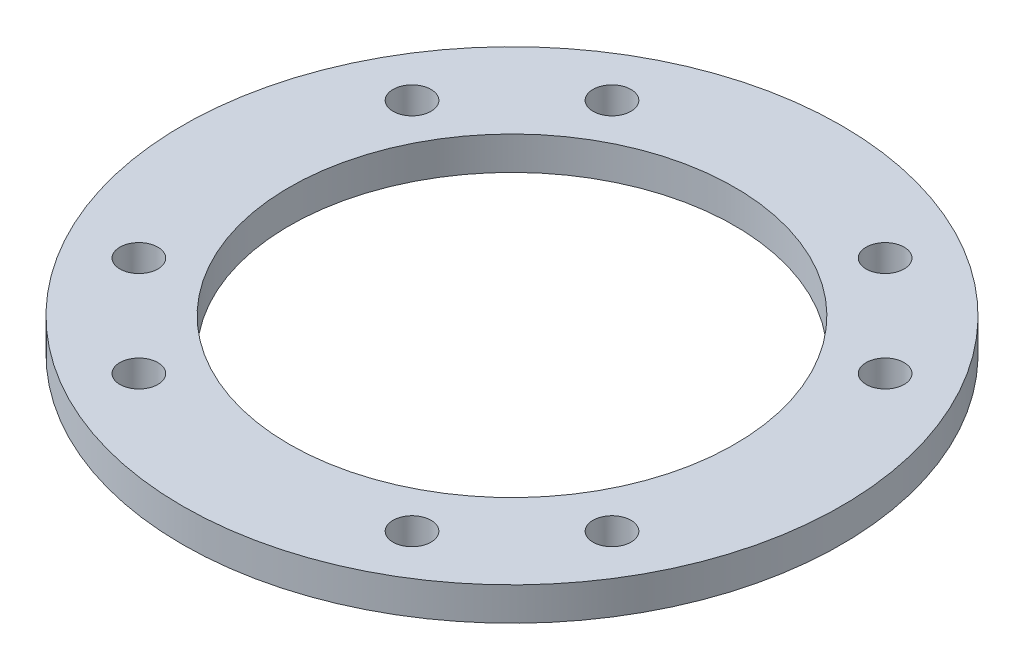
ISO-10303-21;
HEADER;
FILE_DESCRIPTION(('STEP AP214'),'2;1');
FILE_NAME('part.step','',(''),(''),'','','');
FILE_SCHEMA(('AUTOMOTIVE_DESIGN { 1 0 10303 214 1 1 1 1 }'));
ENDSEC;
DATA;
#1=APPLICATION_CONTEXT('core data for automotive mechanical design processes');
#2=APPLICATION_PROTOCOL_DEFINITION('international standard','automotive_design',2000,#1);
#3=PRODUCT_CONTEXT('',#1,'mechanical');
#4=PRODUCT('Part','Part','',(#3));
#5=PRODUCT_RELATED_PRODUCT_CATEGORY('part','',(#4));
#6=PRODUCT_DEFINITION_FORMATION('','',#4);
#7=PRODUCT_DEFINITION_CONTEXT('part definition',#1,'design');
#8=PRODUCT_DEFINITION('design','',#6,#7);
#9=PRODUCT_DEFINITION_SHAPE('','',#8);
#10=(LENGTH_UNIT() NAMED_UNIT(*) SI_UNIT(.MILLI.,.METRE.));
#11=(NAMED_UNIT(*) PLANE_ANGLE_UNIT() SI_UNIT($,.RADIAN.));
#12=(NAMED_UNIT(*) SI_UNIT($,.STERADIAN.) SOLID_ANGLE_UNIT());
#13=UNCERTAINTY_MEASURE_WITH_UNIT(LENGTH_MEASURE(1.E-05),#10,'distance_accuracy_value','');
#14=(GEOMETRIC_REPRESENTATION_CONTEXT(3) GLOBAL_UNCERTAINTY_ASSIGNED_CONTEXT((#13)) GLOBAL_UNIT_ASSIGNED_CONTEXT((#10,
#11,#12)) REPRESENTATION_CONTEXT('',''));
#15=CARTESIAN_POINT('',(0.,0.,0.));
#16=DIRECTION('',(0.,0.,1.));
#17=DIRECTION('',(1.,0.,0.));
#18=AXIS2_PLACEMENT_3D('',#15,#16,#17);
#19=CARTESIAN_POINT('',(0.,-40.6471311900001,0.));
#20=DIRECTION('',(0.,1.,0.));
#21=DIRECTION('',(0.,0.,1.));
#22=AXIS2_PLACEMENT_3D('',#19,#20,#21);
#23=PLANE('',#22);
#24=CARTESIAN_POINT('',(0.,-40.6471311900001,0.));
#25=DIRECTION('',(0.,1.,0.));
#26=DIRECTION('',(0.,0.,1.));
#27=AXIS2_PLACEMENT_3D('',#24,#25,#26);
#28=CIRCLE('',#27,37.5);
#29=CARTESIAN_POINT('',(0.,-40.6471311900001,37.5));
#30=VERTEX_POINT('',#29);
#31=EDGE_CURVE('E99',#30,#30,#28,.T.);
#32=ORIENTED_EDGE('',*,*,#31,.F.);
#33=EDGE_LOOP('',(#32));
#34=FACE_BOUND('',#33,.T.);
#35=CARTESIAN_POINT('',(0.,-40.6471311900001,0.));
#36=DIRECTION('',(0.,1.,0.));
#37=DIRECTION('',(0.,0.,1.));
#38=AXIS2_PLACEMENT_3D('',#35,#36,#37);
#39=CIRCLE('',#38,55.5);
#40=CARTESIAN_POINT('',(0.,-40.6471311900001,55.5));
#41=VERTEX_POINT('',#40);
#42=EDGE_CURVE('E10',#41,#41,#39,.T.);
#43=ORIENTED_EDGE('',*,*,#42,.T.);
#44=EDGE_LOOP('',(#43));
#45=FACE_BOUND('',#44,.T.);
#46=CARTESIAN_POINT('',(-22.9999999999995,-40.6471311900001,-39.8371685740845));
#47=DIRECTION('',(0.,-1.,0.));
#48=DIRECTION('',(0.,0.,-1.));
#49=AXIS2_PLACEMENT_3D('',#46,#47,#48);
#50=CIRCLE('',#49,3.20000000000001);
#51=CARTESIAN_POINT('',(-22.9999999999995,-40.6471311900001,-43.0371685740845));
#52=VERTEX_POINT('',#51);
#53=EDGE_CURVE('E88',#52,#52,#50,.F.);
#54=ORIENTED_EDGE('',*,*,#53,.F.);
#55=EDGE_LOOP('',(#54));
#56=FACE_BOUND('',#55,.T.);
#57=CARTESIAN_POINT('',(-39.8371685740839,-40.6471311900001,-23.0000000000005));
#58=DIRECTION('',(0.,-1.,0.));
#59=DIRECTION('',(0.,0.,-1.));
#60=AXIS2_PLACEMENT_3D('',#57,#58,#59);
#61=CIRCLE('',#60,3.20000000000001);
#62=CARTESIAN_POINT('',(-39.8371685740839,-40.6471311900001,-26.2000000000005));
#63=VERTEX_POINT('',#62);
#64=EDGE_CURVE('E82',#63,#63,#61,.F.);
#65=ORIENTED_EDGE('',*,*,#64,.F.);
#66=EDGE_LOOP('',(#65));
#67=FACE_BOUND('',#66,.T.);
#68=CARTESIAN_POINT('',(-39.8371685740842,-40.6471311900001,22.9999999999999));
#69=DIRECTION('',(0.,-1.,0.));
#70=DIRECTION('',(0.,0.,-1.));
#71=AXIS2_PLACEMENT_3D('',#68,#69,#70);
#72=CIRCLE('',#71,3.20000000000001);
#73=CARTESIAN_POINT('',(-39.8371685740842,-40.6471311900001,19.7999999999999));
#74=VERTEX_POINT('',#73);
#75=EDGE_CURVE('E76',#74,#74,#72,.F.);
#76=ORIENTED_EDGE('',*,*,#75,.F.);
#77=EDGE_LOOP('',(#76));
#78=FACE_BOUND('',#77,.T.);
#79=CARTESIAN_POINT('',(-23.,-40.6471311900001,39.8371685740842));
#80=DIRECTION('',(0.,-1.,0.));
#81=DIRECTION('',(0.,0.,-1.));
#82=AXIS2_PLACEMENT_3D('',#79,#80,#81);
#83=CIRCLE('',#82,3.20000000000001);
#84=CARTESIAN_POINT('',(-19.8,-40.6471311900001,39.8371685740842));
#85=VERTEX_POINT('',#84);
#86=EDGE_CURVE('E70',#85,#85,#83,.F.);
#87=ORIENTED_EDGE('',*,*,#86,.F.);
#88=EDGE_LOOP('',(#87));
#89=FACE_BOUND('',#88,.T.);
#90=CARTESIAN_POINT('',(22.9999999999998,-40.6471311900001,39.8371685740843));
#91=DIRECTION('',(0.,-1.,0.));
#92=DIRECTION('',(0.,0.,-1.));
#93=AXIS2_PLACEMENT_3D('',#90,#91,#92);
#94=CIRCLE('',#93,3.20000000000001);
#95=CARTESIAN_POINT('',(22.9999999999998,-40.6471311900001,36.6371685740843));
#96=VERTEX_POINT('',#95);
#97=EDGE_CURVE('E64',#96,#96,#94,.F.);
#98=ORIENTED_EDGE('',*,*,#97,.F.);
#99=EDGE_LOOP('',(#98));
#100=FACE_BOUND('',#99,.T.);
#101=CARTESIAN_POINT('',(39.8371685740841,-40.6471311900001,23.0000000000002));
#102=DIRECTION('',(0.,-1.,0.));
#103=DIRECTION('',(0.,0.,-1.));
#104=AXIS2_PLACEMENT_3D('',#101,#102,#103);
#105=CIRCLE('',#104,3.20000000000001);
#106=CARTESIAN_POINT('',(39.8371685740841,-40.6471311900001,19.8000000000002));
#107=VERTEX_POINT('',#106);
#108=EDGE_CURVE('E58',#107,#107,#105,.F.);
#109=ORIENTED_EDGE('',*,*,#108,.F.);
#110=EDGE_LOOP('',(#109));
#111=FACE_BOUND('',#110,.T.);
#112=CARTESIAN_POINT('',(39.8371685740843,-40.6471311900001,-22.9999999999999));
#113=DIRECTION('',(0.,-1.,0.));
#114=DIRECTION('',(0.,0.,-1.));
#115=AXIS2_PLACEMENT_3D('',#112,#113,#114);
#116=CIRCLE('',#115,3.20000000000001);
#117=CARTESIAN_POINT('',(39.8371685740843,-40.6471311900001,-26.1999999999999));
#118=VERTEX_POINT('',#117);
#119=EDGE_CURVE('E53',#118,#118,#116,.F.);
#120=ORIENTED_EDGE('',*,*,#119,.F.);
#121=EDGE_LOOP('',(#120));
#122=FACE_BOUND('',#121,.T.);
#123=CARTESIAN_POINT('',(23.0000000000001,-40.6471311900001,-39.8371685740842));
#124=DIRECTION('',(0.,-1.,0.));
#125=DIRECTION('',(0.,0.,-1.));
#126=AXIS2_PLACEMENT_3D('',#123,#124,#125);
#127=CIRCLE('',#126,3.20000000000001);
#128=CARTESIAN_POINT('',(23.0000000000001,-40.6471311900001,-43.0371685740842));
#129=VERTEX_POINT('',#128);
#130=EDGE_CURVE('E45',#129,#129,#127,.F.);
#131=ORIENTED_EDGE('',*,*,#130,.F.);
#132=EDGE_LOOP('',(#131));
#133=FACE_BOUND('',#132,.T.);
#134=ADVANCED_FACE('F35',(#34,#45,#56,#67,#78,#89,#100,#111,#122,#133),#23,.T.);
#135=CARTESIAN_POINT('',(55.5,-46.25,0.));
#136=DIRECTION('',(0.,1.,0.));
#137=DIRECTION('',(0.,0.,1.));
#138=AXIS2_PLACEMENT_3D('',#135,#136,#137);
#139=PLANE('',#138);
#140=CARTESIAN_POINT('',(0.,-46.25,0.));
#141=DIRECTION('',(0.,1.,0.));
#142=DIRECTION('',(0.,0.,1.));
#143=AXIS2_PLACEMENT_3D('',#140,#141,#142);
#144=CIRCLE('',#143,37.5);
#145=CARTESIAN_POINT('',(0.,-46.25,37.5));
#146=VERTEX_POINT('',#145);
#147=EDGE_CURVE('E94',#146,#146,#144,.F.);
#148=ORIENTED_EDGE('',*,*,#147,.F.);
#149=EDGE_LOOP('',(#148));
#150=FACE_BOUND('',#149,.T.);
#151=CARTESIAN_POINT('',(-22.9999999999995,-46.25,-39.8371685740845));
#152=DIRECTION('',(0.,-1.,0.));
#153=DIRECTION('',(0.50000000000001,0.,-0.866025403784433));
#154=AXIS2_PLACEMENT_3D('',#151,#152,#153);
#155=CIRCLE('',#154,3.20000000000001);
#156=CARTESIAN_POINT('',(-21.3999999999994,-46.25,-42.6084498661947));
#157=VERTEX_POINT('',#156);
#158=EDGE_CURVE('E91',#157,#157,#155,.T.);
#159=ORIENTED_EDGE('',*,*,#158,.F.);
#160=EDGE_LOOP('',(#159));
#161=FACE_BOUND('',#160,.T.);
#162=CARTESIAN_POINT('',(-39.8371685740839,-46.25,-23.0000000000005));
#163=DIRECTION('',(0.,-1.,0.));
#164=DIRECTION('',(0.,0.,-1.));
#165=AXIS2_PLACEMENT_3D('',#162,#163,#164);
#166=CIRCLE('',#165,3.20000000000001);
#167=CARTESIAN_POINT('',(-39.8371685740839,-46.25,-26.2000000000005));
#168=VERTEX_POINT('',#167);
#169=EDGE_CURVE('E85',#168,#168,#166,.T.);
#170=ORIENTED_EDGE('',*,*,#169,.F.);
#171=EDGE_LOOP('',(#170));
#172=FACE_BOUND('',#171,.T.);
#173=CARTESIAN_POINT('',(-39.8371685740842,-46.25,22.9999999999999));
#174=DIRECTION('',(0.,-1.,0.));
#175=DIRECTION('',(-0.866025403784438,0.,-0.500000000000001));
#176=AXIS2_PLACEMENT_3D('',#173,#174,#175);
#177=CIRCLE('',#176,3.20000000000001);
#178=CARTESIAN_POINT('',(-42.6084498661944,-46.25,21.3999999999999));
#179=VERTEX_POINT('',#178);
#180=EDGE_CURVE('E79',#179,#179,#177,.T.);
#181=ORIENTED_EDGE('',*,*,#180,.F.);
#182=EDGE_LOOP('',(#181));
#183=FACE_BOUND('',#182,.T.);
#184=CARTESIAN_POINT('',(-23.,-46.25,39.8371685740842));
#185=DIRECTION('',(0.,-1.,0.));
#186=DIRECTION('',(-1.,0.,0.));
#187=AXIS2_PLACEMENT_3D('',#184,#185,#186);
#188=CIRCLE('',#187,3.20000000000001);
#189=CARTESIAN_POINT('',(-19.8,-46.25,39.8371685740842));
#190=VERTEX_POINT('',#189);
#191=EDGE_CURVE('E73',#190,#190,#188,.T.);
#192=ORIENTED_EDGE('',*,*,#191,.F.);
#193=EDGE_LOOP('',(#192));
#194=FACE_BOUND('',#193,.T.);
#195=CARTESIAN_POINT('',(22.9999999999998,-46.25,39.8371685740843));
#196=DIRECTION('',(0.,-1.,0.));
#197=DIRECTION('',(-0.500000000000004,0.,0.866025403784436));
#198=AXIS2_PLACEMENT_3D('',#195,#196,#197);
#199=CIRCLE('',#198,3.20000000000001);
#200=CARTESIAN_POINT('',(21.3999999999998,-46.25,42.6084498661945));
#201=VERTEX_POINT('',#200);
#202=EDGE_CURVE('E67',#201,#201,#199,.T.);
#203=ORIENTED_EDGE('',*,*,#202,.F.);
#204=EDGE_LOOP('',(#203));
#205=FACE_BOUND('',#204,.T.);
#206=CARTESIAN_POINT('',(39.8371685740841,-46.25,23.0000000000002));
#207=DIRECTION('',(0.,-1.,0.));
#208=DIRECTION('',(0.,0.,1.));
#209=AXIS2_PLACEMENT_3D('',#206,#207,#208);
#210=CIRCLE('',#209,3.20000000000001);
#211=CARTESIAN_POINT('',(39.8371685740841,-46.25,26.2000000000002));
#212=VERTEX_POINT('',#211);
#213=EDGE_CURVE('E61',#212,#212,#210,.T.);
#214=ORIENTED_EDGE('',*,*,#213,.F.);
#215=EDGE_LOOP('',(#214));
#216=FACE_BOUND('',#215,.T.);
#217=CARTESIAN_POINT('',(39.8371685740843,-46.25,-22.9999999999999));
#218=DIRECTION('',(0.,-1.,0.));
#219=DIRECTION('',(0.866025403784438,0.,0.500000000000001));
#220=AXIS2_PLACEMENT_3D('',#217,#218,#219);
#221=CIRCLE('',#220,3.20000000000001);
#222=CARTESIAN_POINT('',(42.6084498661945,-46.25,-21.3999999999999));
#223=VERTEX_POINT('',#222);
#224=EDGE_CURVE('E55',#223,#223,#221,.T.);
#225=ORIENTED_EDGE('',*,*,#224,.F.);
#226=EDGE_LOOP('',(#225));
#227=FACE_BOUND('',#226,.T.);
#228=CARTESIAN_POINT('',(23.0000000000001,-46.25,-39.8371685740842));
#229=DIRECTION('',(0.,-1.,0.));
#230=DIRECTION('',(1.,0.,0.));
#231=AXIS2_PLACEMENT_3D('',#228,#229,#230);
#232=CIRCLE('',#231,3.20000000000001);
#233=CARTESIAN_POINT('',(26.2000000000001,-46.25,-39.8371685740842));
#234=VERTEX_POINT('',#233);
#235=EDGE_CURVE('E49',#234,#234,#232,.T.);
#236=ORIENTED_EDGE('',*,*,#235,.F.);
#237=EDGE_LOOP('',(#236));
#238=FACE_BOUND('',#237,.T.);
#239=CARTESIAN_POINT('',(0.,-46.25,0.));
#240=DIRECTION('',(0.,1.,0.));
#241=DIRECTION('',(0.,0.,1.));
#242=AXIS2_PLACEMENT_3D('',#239,#240,#241);
#243=CIRCLE('',#242,55.5);
#244=CARTESIAN_POINT('',(0.,-46.25,55.5));
#245=VERTEX_POINT('',#244);
#246=EDGE_CURVE('E41',#245,#245,#243,.T.);
#247=ORIENTED_EDGE('',*,*,#246,.F.);
#248=EDGE_LOOP('',(#247));
#249=FACE_BOUND('',#248,.T.);
#250=ADVANCED_FACE('F107',(#150,#161,#172,#183,#194,#205,#216,#227,#238,#249),#139,.F.);
#251=CARTESIAN_POINT('',(0.,-40.25,0.));
#252=DIRECTION('',(0.,1.,0.));
#253=DIRECTION('',(0.,0.,1.));
#254=AXIS2_PLACEMENT_3D('',#251,#252,#253);
#255=CYLINDRICAL_SURFACE('',#254,55.5);
#256=ORIENTED_EDGE('',*,*,#42,.F.);
#257=EDGE_LOOP('',(#256));
#258=FACE_BOUND('',#257,.T.);
#259=ORIENTED_EDGE('',*,*,#246,.T.);
#260=EDGE_LOOP('',(#259));
#261=FACE_BOUND('',#260,.T.);
#262=ADVANCED_FACE('F144',(#258,#261),#255,.T.);
#263=CARTESIAN_POINT('',(-23.0000000000001,0.00100000000036876,39.8371685740842));
#264=DIRECTION('',(0.,-1.,0.));
#265=DIRECTION('',(1.,0.,0.));
#266=AXIS2_PLACEMENT_3D('',#263,#264,#265);
#267=CYLINDRICAL_SURFACE('',#266,3.20000000000001);
#268=CARTESIAN_POINT('',(-19.8,-46.25,39.8371685740842));
#269=CARTESIAN_POINT('',(-19.8,-46.1916367832292,39.8371685740842));
#270=CARTESIAN_POINT('',(-19.8,-46.1332735664584,39.8371685740842));
#271=CARTESIAN_POINT('',(-19.8,-46.0165471329167,39.8371685740842));
#272=CARTESIAN_POINT('',(-19.8,-45.9581839161459,39.8371685740842));
#273=CARTESIAN_POINT('',(-19.8,-45.8414574826042,39.8371685740842));
#274=CARTESIAN_POINT('',(-19.8,-45.7830942658334,39.8371685740842));
#275=CARTESIAN_POINT('',(-19.8,-45.6663678322917,39.8371685740842));
#276=CARTESIAN_POINT('',(-19.8,-45.6080046155209,39.8371685740842));
#277=CARTESIAN_POINT('',(-19.8,-45.4912781819792,39.8371685740842));
#278=CARTESIAN_POINT('',(-19.8,-45.4329149652084,39.8371685740842));
#279=CARTESIAN_POINT('',(-19.8,-45.3161885316667,39.8371685740842));
#280=CARTESIAN_POINT('',(-19.8,-45.2578253148959,39.8371685740842));
#281=CARTESIAN_POINT('',(-19.8,-45.1410988813542,39.8371685740842));
#282=CARTESIAN_POINT('',(-19.8,-45.0827356645834,39.8371685740842));
#283=CARTESIAN_POINT('',(-19.8,-44.9660092310417,39.8371685740842));
#284=CARTESIAN_POINT('',(-19.8,-44.9076460142709,39.8371685740842));
#285=CARTESIAN_POINT('',(-19.8,-44.7909195807292,39.8371685740842));
#286=CARTESIAN_POINT('',(-19.8,-44.7325563639584,39.8371685740842));
#287=CARTESIAN_POINT('',(-19.8,-44.6158299304167,39.8371685740842));
#288=CARTESIAN_POINT('',(-19.8,-44.5574667136459,39.8371685740842));
#289=CARTESIAN_POINT('',(-19.8,-44.4407402801042,39.8371685740842));
#290=CARTESIAN_POINT('',(-19.8,-44.3823770633334,39.8371685740842));
#291=CARTESIAN_POINT('',(-19.8,-44.2656506297917,39.8371685740842));
#292=CARTESIAN_POINT('',(-19.8,-44.2072874130209,39.8371685740842));
#293=CARTESIAN_POINT('',(-19.8,-44.0905609794792,39.8371685740842));
#294=CARTESIAN_POINT('',(-19.8,-44.0321977627084,39.8371685740842));
#295=CARTESIAN_POINT('',(-19.8,-43.9154713291667,39.8371685740842));
#296=CARTESIAN_POINT('',(-19.8,-43.8571081123959,39.8371685740842));
#297=CARTESIAN_POINT('',(-19.8,-43.7403816788542,39.8371685740842));
#298=CARTESIAN_POINT('',(-19.8,-43.6820184620834,39.8371685740842));
#299=CARTESIAN_POINT('',(-19.8,-43.5652920285417,39.8371685740842));
#300=CARTESIAN_POINT('',(-19.8,-43.5069288117709,39.8371685740842));
#301=CARTESIAN_POINT('',(-19.8,-43.3902023782292,39.8371685740842));
#302=CARTESIAN_POINT('',(-19.8,-43.3318391614584,39.8371685740842));
#303=CARTESIAN_POINT('',(-19.8,-43.2151127279167,39.8371685740842));
#304=CARTESIAN_POINT('',(-19.8,-43.1567495111459,39.8371685740842));
#305=CARTESIAN_POINT('',(-19.8,-43.0400230776042,39.8371685740842));
#306=CARTESIAN_POINT('',(-19.8,-42.9816598608334,39.8371685740842));
#307=CARTESIAN_POINT('',(-19.8,-42.8649334272917,39.8371685740842));
#308=CARTESIAN_POINT('',(-19.8,-42.8065702105209,39.8371685740842));
#309=CARTESIAN_POINT('',(-19.8,-42.6898437769792,39.8371685740842));
#310=CARTESIAN_POINT('',(-19.8,-42.6314805602084,39.8371685740842));
#311=CARTESIAN_POINT('',(-19.8,-42.5147541266667,39.8371685740842));
#312=CARTESIAN_POINT('',(-19.8,-42.4563909098959,39.8371685740842));
#313=CARTESIAN_POINT('',(-19.8,-42.3396644763542,39.8371685740842));
#314=CARTESIAN_POINT('',(-19.8,-42.2813012595834,39.8371685740842));
#315=CARTESIAN_POINT('',(-19.8,-42.1645748260417,39.8371685740842));
#316=CARTESIAN_POINT('',(-19.8,-42.1062116092709,39.8371685740842));
#317=CARTESIAN_POINT('',(-19.8,-41.9894851757292,39.8371685740842));
#318=CARTESIAN_POINT('',(-19.8,-41.9311219589584,39.8371685740842));
#319=CARTESIAN_POINT('',(-19.8,-41.8143955254167,39.8371685740842));
#320=CARTESIAN_POINT('',(-19.8,-41.7560323086459,39.8371685740842));
#321=CARTESIAN_POINT('',(-19.8,-41.6393058751042,39.8371685740842));
#322=CARTESIAN_POINT('',(-19.8,-41.5809426583334,39.8371685740842));
#323=CARTESIAN_POINT('',(-19.8,-41.4642162247917,39.8371685740842));
#324=CARTESIAN_POINT('',(-19.8,-41.4058530080209,39.8371685740842));
#325=CARTESIAN_POINT('',(-19.8,-41.2891265744792,39.8371685740842));
#326=CARTESIAN_POINT('',(-19.8,-41.2307633577084,39.8371685740842));
#327=CARTESIAN_POINT('',(-19.8,-41.1140369241667,39.8371685740842));
#328=CARTESIAN_POINT('',(-19.8,-41.0556737073959,39.8371685740842));
#329=CARTESIAN_POINT('',(-19.8,-40.9389472738542,39.8371685740842));
#330=CARTESIAN_POINT('',(-19.8,-40.8805840570834,39.8371685740842));
#331=CARTESIAN_POINT('',(-19.8,-40.7638576235417,39.8371685740842));
#332=CARTESIAN_POINT('',(-19.8,-40.7054944067709,39.8371685740842));
#333=CARTESIAN_POINT('',(-19.8,-40.6471311900001,39.8371685740842));
#334=B_SPLINE_CURVE_WITH_KNOTS('',3,(#268,#269,#270,#271,#272,#273,#274,#275,#276,#277,#278,
#279,#280,#281,#282,#283,#284,#285,#286,#287,#288,#289,#290,#291,#292,#293,#294,#295,#296,#297,
#298,#299,#300,#301,#302,#303,#304,#305,#306,#307,#308,#309,#310,#311,#312,#313,#314,#315,#316,
#317,#318,#319,#320,#321,#322,#323,#324,#325,#326,#327,#328,#329,#330,#331,#332,#333),
.UNSPECIFIED.,.F.,.F.,(4,2,2,2,2,2,2,2,2,2,2,2,2,2,2,2,2,2,2,2,2,2,2,2,2,2,2,2,2,2,2,2,4),(0.,
0.175089650312502,0.350179300624996,0.525268950937498,0.700358601249992,0.875448251562494,
1.050537901875,1.22562755218749,1.40071720249999,1.57580685281249,1.75089650312499,
1.92598615343749,2.10107580374999,2.27616545406249,2.45125510437499,2.62634475468748,
2.80143440499998,2.97652405531248,3.15161370562498,3.32670335593748,3.50179300624998,
3.67688265656248,3.85197230687498,4.02706195718747,4.20215160749998,4.37724125781248,
4.55233090812497,4.72742055843747,4.90251020874997,5.07759985906247,5.25268950937497,
5.42777915968747,5.60286880999997),.UNSPECIFIED.);
#335=EDGE_CURVE('BSEAM139',#190,#85,#334,.T.);
#336=ORIENTED_EDGE('',*,*,#191,.T.);
#337=ORIENTED_EDGE('',*,*,#86,.T.);
#338=ORIENTED_EDGE('',*,*,#335,.T.);
#339=ORIENTED_EDGE('',*,*,#335,.F.);
#340=EDGE_LOOP('',(#336,#338,#337,#339));
#341=FACE_BOUND('',#340,.T.);
#342=ADVANCED_FACE('F139',(#341),#267,.F.);
#343=CARTESIAN_POINT('',(-39.8371685740843,0.00100000000040346,22.9999999999999));
#344=DIRECTION('',(0.,-1.,0.));
#345=DIRECTION('',(1.,0.,0.));
#346=AXIS2_PLACEMENT_3D('',#343,#344,#345);
#347=CYLINDRICAL_SURFACE('',#346,3.20000000000001);
#348=ORIENTED_EDGE('',*,*,#180,.T.);
#349=EDGE_LOOP('',(#348));
#350=FACE_BOUND('',#349,.T.);
#351=ORIENTED_EDGE('',*,*,#75,.T.);
#352=EDGE_LOOP('',(#351));
#353=FACE_BOUND('',#352,.T.);
#354=ADVANCED_FACE('F129',(#350,#353),#347,.F.);
#355=CARTESIAN_POINT('',(23.0000000000001,0.00100000000013284,-39.8371685740842));
#356=DIRECTION('',(0.,-1.,0.));
#357=DIRECTION('',(0.,0.,-1.));
#358=AXIS2_PLACEMENT_3D('',#355,#356,#357);
#359=CYLINDRICAL_SURFACE('',#358,3.20000000000001);
#360=ORIENTED_EDGE('',*,*,#235,.T.);
#361=EDGE_LOOP('',(#360));
#362=FACE_BOUND('',#361,.T.);
#363=ORIENTED_EDGE('',*,*,#130,.T.);
#364=EDGE_LOOP('',(#363));
#365=FACE_BOUND('',#364,.T.);
#366=ADVANCED_FACE('F126',(#362,#365),#359,.F.);
#367=CARTESIAN_POINT('',(39.8371685740843,0.00100000000022998,-22.9999999999999));
#368=DIRECTION('',(0.,-1.,0.));
#369=DIRECTION('',(0.,0.,-1.));
#370=AXIS2_PLACEMENT_3D('',#367,#368,#369);
#371=CYLINDRICAL_SURFACE('',#370,3.20000000000001);
#372=ORIENTED_EDGE('',*,*,#224,.T.);
#373=EDGE_LOOP('',(#372));
#374=FACE_BOUND('',#373,.T.);
#375=ORIENTED_EDGE('',*,*,#119,.T.);
#376=EDGE_LOOP('',(#375));
#377=FACE_BOUND('',#376,.T.);
#378=ADVANCED_FACE('F128',(#374,#377),#371,.F.);
#379=CARTESIAN_POINT('',(-39.8371685740839,0.00100000000035488,-23.0000000000005));
#380=DIRECTION('',(0.,-1.,0.));
#381=DIRECTION('',(0.,0.,-1.));
#382=AXIS2_PLACEMENT_3D('',#379,#380,#381);
#383=CYLINDRICAL_SURFACE('',#382,3.20000000000001);
#384=ORIENTED_EDGE('',*,*,#169,.T.);
#385=EDGE_LOOP('',(#384));
#386=FACE_BOUND('',#385,.T.);
#387=ORIENTED_EDGE('',*,*,#64,.T.);
#388=EDGE_LOOP('',(#387));
#389=FACE_BOUND('',#388,.T.);
#390=ADVANCED_FACE('F136',(#386,#389),#383,.F.);
#391=CARTESIAN_POINT('',(-22.9999999999995,0.00100000000028549,-39.8371685740845));
#392=DIRECTION('',(0.,-1.,0.));
#393=DIRECTION('',(0.,0.,-1.));
#394=AXIS2_PLACEMENT_3D('',#391,#392,#393);
#395=CYLINDRICAL_SURFACE('',#394,3.20000000000001);
#396=ORIENTED_EDGE('',*,*,#158,.T.);
#397=EDGE_LOOP('',(#396));
#398=FACE_BOUND('',#397,.T.);
#399=ORIENTED_EDGE('',*,*,#53,.T.);
#400=EDGE_LOOP('',(#399));
#401=FACE_BOUND('',#400,.T.);
#402=ADVANCED_FACE('F173',(#398,#401),#395,.F.);
#403=CARTESIAN_POINT('',(39.8371685740841,0.00100000000041039,23.0000000000002));
#404=DIRECTION('',(0.,-1.,0.));
#405=DIRECTION('',(1.,0.,0.));
#406=AXIS2_PLACEMENT_3D('',#403,#404,#405);
#407=CYLINDRICAL_SURFACE('',#406,3.20000000000001);
#408=ORIENTED_EDGE('',*,*,#213,.T.);
#409=EDGE_LOOP('',(#408));
#410=FACE_BOUND('',#409,.T.);
#411=ORIENTED_EDGE('',*,*,#108,.T.);
#412=EDGE_LOOP('',(#411));
#413=FACE_BOUND('',#412,.T.);
#414=ADVANCED_FACE('F170',(#410,#413),#407,.F.);
#415=CARTESIAN_POINT('',(22.9999999999998,0.00100000000044509,39.8371685740843));
#416=DIRECTION('',(0.,-1.,0.));
#417=DIRECTION('',(1.,0.,0.));
#418=AXIS2_PLACEMENT_3D('',#415,#416,#417);
#419=CYLINDRICAL_SURFACE('',#418,3.20000000000001);
#420=ORIENTED_EDGE('',*,*,#202,.T.);
#421=EDGE_LOOP('',(#420));
#422=FACE_BOUND('',#421,.T.);
#423=ORIENTED_EDGE('',*,*,#97,.T.);
#424=EDGE_LOOP('',(#423));
#425=FACE_BOUND('',#424,.T.);
#426=ADVANCED_FACE('F108',(#422,#425),#419,.F.);
#427=CARTESIAN_POINT('',(0.,-46.2510000000001,0.));
#428=DIRECTION('',(0.,1.,0.));
#429=DIRECTION('',(0.,0.,1.));
#430=AXIS2_PLACEMENT_3D('',#427,#428,#429);
#431=CYLINDRICAL_SURFACE('',#430,37.5);
#432=ORIENTED_EDGE('',*,*,#31,.T.);
#433=EDGE_LOOP('',(#432));
#434=FACE_BOUND('',#433,.T.);
#435=ORIENTED_EDGE('',*,*,#147,.T.);
#436=EDGE_LOOP('',(#435));
#437=FACE_BOUND('',#436,.T.);
#438=ADVANCED_FACE('F103',(#434,#437),#431,.F.);
#439=CLOSED_SHELL('',(#134,#250,#262,#342,#354,#366,#378,#390,#402,#414,#426,#438));
#440=MANIFOLD_SOLID_BREP('B2',#439);
#441=ADVANCED_BREP_SHAPE_REPRESENTATION('',(#18,#440),#14);
#442=SHAPE_DEFINITION_REPRESENTATION(#9,#441);
ENDSEC;
END-ISO-10303-21;
